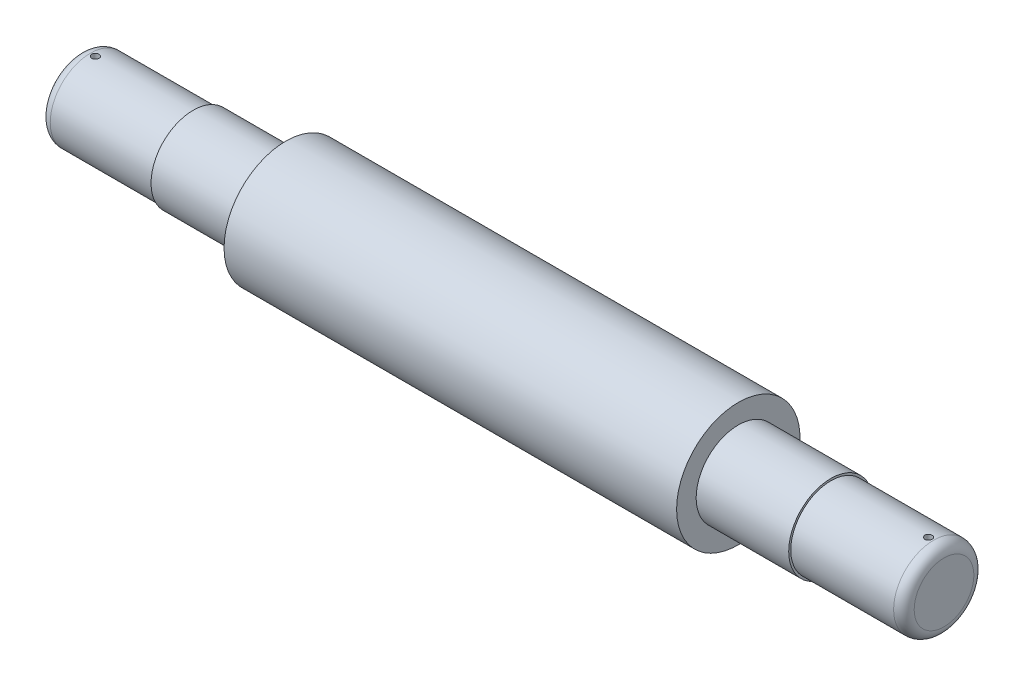
ISO-10303-21;
HEADER;
FILE_DESCRIPTION(('STEP AP214'),'2;1');
FILE_NAME('part.step','',(''),(''),'','','');
FILE_SCHEMA(('AUTOMOTIVE_DESIGN { 1 0 10303 214 1 1 1 1 }'));
ENDSEC;
DATA;
#1=APPLICATION_CONTEXT('core data for automotive mechanical design processes');
#2=APPLICATION_PROTOCOL_DEFINITION('international standard','automotive_design',2000,#1);
#3=PRODUCT_CONTEXT('',#1,'mechanical');
#4=PRODUCT('Part','Part','',(#3));
#5=PRODUCT_RELATED_PRODUCT_CATEGORY('part','',(#4));
#6=PRODUCT_DEFINITION_FORMATION('','',#4);
#7=PRODUCT_DEFINITION_CONTEXT('part definition',#1,'design');
#8=PRODUCT_DEFINITION('design','',#6,#7);
#9=PRODUCT_DEFINITION_SHAPE('','',#8);
#10=(LENGTH_UNIT() NAMED_UNIT(*) SI_UNIT(.MILLI.,.METRE.));
#11=(NAMED_UNIT(*) PLANE_ANGLE_UNIT() SI_UNIT($,.RADIAN.));
#12=(NAMED_UNIT(*) SI_UNIT($,.STERADIAN.) SOLID_ANGLE_UNIT());
#13=UNCERTAINTY_MEASURE_WITH_UNIT(LENGTH_MEASURE(1.E-05),#10,'distance_accuracy_value','');
#14=(GEOMETRIC_REPRESENTATION_CONTEXT(3) GLOBAL_UNCERTAINTY_ASSIGNED_CONTEXT((#13)) GLOBAL_UNIT_ASSIGNED_CONTEXT((#10,
#11,#12)) REPRESENTATION_CONTEXT('',''));
#15=CARTESIAN_POINT('',(0.,0.,0.));
#16=DIRECTION('',(0.,0.,1.));
#17=DIRECTION('',(1.,0.,0.));
#18=AXIS2_PLACEMENT_3D('',#15,#16,#17);
#19=CARTESIAN_POINT('',(48.555065461317,23.4884754613633,0.));
#20=DIRECTION('',(-1.,0.,0.));
#21=DIRECTION('',(0.,0.,1.));
#22=AXIS2_PLACEMENT_3D('',#19,#20,#21);
#23=CYLINDRICAL_SURFACE('',#22,39.);
#24=CARTESIAN_POINT('',(63.555065461317,-15.3541557574406,3.50000000000001));
#25=CARTESIAN_POINT('',(63.7512368152284,-15.3541578341568,3.49999145551542));
#26=CARTESIAN_POINT('',(63.9475403255315,-15.3556578813005,3.48345169220776));
#27=CARTESIAN_POINT('',(64.3347118490182,-15.3614956569584,3.41771718774952));
#28=CARTESIAN_POINT('',(64.5255735138069,-15.3658365687378,3.36848581386032));
#29=CARTESIAN_POINT('',(64.8961980155346,-15.376860489544,3.23880695521626));
#30=CARTESIAN_POINT('',(65.0759672328572,-15.3835421371255,3.15837761326698));
#31=CARTESIAN_POINT('',(65.4194126724575,-15.3984929848442,2.96861914891895));
#32=CARTESIAN_POINT('',(65.5830922366216,-15.406761854251,2.85929604534648));
#33=CARTESIAN_POINT('',(65.8902372036992,-15.4239828637668,2.6145050971832));
#34=CARTESIAN_POINT('',(66.033648442496,-15.4329367396969,2.47896940739303));
#35=CARTESIAN_POINT('',(66.2957200892986,-15.4505030458845,2.18574481528785));
#36=CARTESIAN_POINT('',(66.4143793976001,-15.4591154609575,2.02805492920405));
#37=CARTESIAN_POINT('',(66.6237620275306,-15.4750452009228,1.69467143545592));
#38=CARTESIAN_POINT('',(66.7144380318671,-15.4823603234228,1.51894799581182));
#39=CARTESIAN_POINT('',(66.864977427285,-15.4948524811561,1.15469326390172));
#40=CARTESIAN_POINT('',(66.9248414344557,-15.5000295591393,0.966162227810391));
#41=CARTESIAN_POINT('',(67.0119003596806,-15.5076501582822,0.582186665545917));
#42=CARTESIAN_POINT('',(67.0391834848042,-15.5101010588523,0.386762287366235));
#43=CARTESIAN_POINT('',(67.0605789480137,-15.5120181965239,-0.00590620968397433));
#44=CARTESIAN_POINT('',(67.0546919913814,-15.5114844970855,-0.203150289773911));
#45=CARTESIAN_POINT('',(67.0099863409019,-15.5074986383165,-0.593260809196251));
#46=CARTESIAN_POINT('',(66.9712624981442,-15.5040548849309,-0.786138216066892));
#47=CARTESIAN_POINT('',(66.8621298904162,-15.4946458070888,-1.16264480438846));
#48=CARTESIAN_POINT('',(66.7917207834558,-15.4886804554159,-1.34627388599521));
#49=CARTESIAN_POINT('',(66.6211112126034,-15.4748846639444,-1.69937206503459));
#50=CARTESIAN_POINT('',(66.5208684532224,-15.4670515793967,-1.86882061866413));
#51=CARTESIAN_POINT('',(66.2934678102492,-15.450400111861,-2.18852351631521));
#52=CARTESIAN_POINT('',(66.1663092921916,-15.4415817056492,-2.33877740774117));
#53=CARTESIAN_POINT('',(65.8881525218487,-15.4239134280755,-2.6163807639313));
#54=CARTESIAN_POINT('',(65.7370718162284,-15.415063555371,-2.74364762537274));
#55=CARTESIAN_POINT('',(65.4156461080213,-15.3983609529404,-2.9710256228864));
#56=CARTESIAN_POINT('',(65.2453010856194,-15.39050822424,-3.07113673102592));
#57=CARTESIAN_POINT('',(64.8901222238229,-15.3766878612599,-3.2413592867816));
#58=CARTESIAN_POINT('',(64.705286176112,-15.3707205149972,-3.31146615143586));
#59=CARTESIAN_POINT('',(64.326401091481,-15.3613523551882,-3.41962746054533));
#60=CARTESIAN_POINT('',(64.1323522798194,-15.3579514789244,-3.45768268825988));
#61=CARTESIAN_POINT('',(63.7412736705709,-15.3541117775242,-3.50055529339454));
#62=CARTESIAN_POINT('',(63.5442566124633,-15.3536626750283,-3.50548799670296));
#63=CARTESIAN_POINT('',(63.1521985267533,-15.355750248953,-3.48227790852231));
#64=CARTESIAN_POINT('',(62.957157477749,-15.3582868930004,-3.45413547565214));
#65=CARTESIAN_POINT('',(62.5749208328978,-15.3660507837781,-3.36567024424415));
#66=CARTESIAN_POINT('',(62.3877126215593,-15.3712735085365,-3.30540152357879));
#67=CARTESIAN_POINT('',(62.026064527109,-15.3838173772624,-3.15444958350481));
#68=CARTESIAN_POINT('',(61.8516248809837,-15.3911385601652,-3.06376579976252));
#69=CARTESIAN_POINT('',(61.5199386326445,-15.407079342608,-2.85426715206876));
#70=CARTESIAN_POINT('',(61.3627406438149,-15.4157024583502,-2.73537559317641));
#71=CARTESIAN_POINT('',(61.0704919086639,-15.4332637570525,-2.47294675046716));
#72=CARTESIAN_POINT('',(60.9354416040444,-15.442201946292,-2.32940897523568));
#73=CARTESIAN_POINT('',(60.690926699227,-15.4594170465009,-2.02126313925078));
#74=CARTESIAN_POINT('',(60.5815371398663,-15.4676919725292,-1.85659540709258));
#75=CARTESIAN_POINT('',(60.3919643172158,-15.4826194794186,-1.51116034452477));
#76=CARTESIAN_POINT('',(60.3117807222644,-15.4892720787025,-1.33039319696841));
#77=CARTESIAN_POINT('',(60.1830241948486,-15.5001962970917,-0.95815698288136));
#78=CARTESIAN_POINT('',(60.1344052517367,-15.5044713805053,-0.76670393721284));
#79=CARTESIAN_POINT('',(60.0700078399733,-15.5101730052554,-0.378311887894353));
#80=CARTESIAN_POINT('',(60.0542286404201,-15.5115996099893,-0.18137300643941));
#81=CARTESIAN_POINT('',(60.0559677775512,-15.511443589429,0.211661619986728));
#82=CARTESIAN_POINT('',(60.0733693336731,-15.509871518049,0.407757896423246));
#83=CARTESIAN_POINT('',(60.1407319953062,-15.5039156257297,0.794230391141328));
#84=CARTESIAN_POINT('',(60.1906931388968,-15.4995318015021,0.98460660273284));
#85=CARTESIAN_POINT('',(60.3217260721343,-15.4884440045549,1.35423930296738));
#86=CARTESIAN_POINT('',(60.4027952665748,-15.4817402253835,1.53349671775348));
#87=CARTESIAN_POINT('',(60.5937300921252,-15.4667615166575,1.87587668635211));
#88=CARTESIAN_POINT('',(60.7035953727661,-15.458486606225,2.03899943650183));
#89=CARTESIAN_POINT('',(60.9494422531216,-15.4412590327391,2.34507779768316));
#90=CARTESIAN_POINT('',(61.0855105434563,-15.4323041814419,2.48796365460531));
#91=CARTESIAN_POINT('',(61.3797377879566,-15.4147446280086,2.74893100858392));
#92=CARTESIAN_POINT('',(61.5379020656076,-15.4061400108999,2.86700651097744));
#93=CARTESIAN_POINT('',(61.8721862253256,-15.3902355700081,3.07518877025833));
#94=CARTESIAN_POINT('',(62.0483433419737,-15.3829385417141,3.16523590109129));
#95=CARTESIAN_POINT('',(62.4132251320003,-15.3705092401194,3.31435645502547));
#96=CARTESIAN_POINT('',(62.6019351765156,-15.3653744964054,3.37346524409687));
#97=CARTESIAN_POINT('',(62.9189630883951,-15.3591624139867,3.44409072604449));
#98=CARTESIAN_POINT('',(63.0452462190051,-15.3572936380399,3.46502855109785));
#99=CARTESIAN_POINT('',(63.2993560028734,-15.3547896348484,3.49298595077845));
#100=CARTESIAN_POINT('',(63.4271826511747,-15.3541544036431,3.50000557009309));
#101=CARTESIAN_POINT('',(63.555065461317,-15.3541557574406,3.50000000000001));
#102=B_SPLINE_CURVE_WITH_KNOTS('',3,(#24,#25,#26,#27,#28,#29,#30,#31,#32,#33,#34,#35,#36,#37,
#38,#39,#40,#41,#42,#43,#44,#45,#46,#47,#48,#49,#50,#51,#52,#53,#54,#55,#56,#57,#58,#59,#60,#61,
#62,#63,#64,#65,#66,#67,#68,#69,#70,#71,#72,#73,#74,#75,#76,#77,#78,#79,#80,#81,#82,#83,#84,#85,
#86,#87,#88,#89,#90,#91,#92,#93,#94,#95,#96,#97,#98,#99,#100,#101),.UNSPECIFIED.,.T.,.F.,(4,2,2,
2,2,2,2,2,2,2,2,2,2,2,2,2,2,2,2,2,2,2,2,2,2,2,2,2,2,2,2,2,2,2,2,2,2,2,4),(0.,0.588047108649064,
1.17675427072277,1.76511958921107,2.35336244246258,2.94314870991699,3.53296117542504,
4.12376556522433,4.71455814136408,5.30374759674227,5.89292452447818,6.48040535797843,
7.0678925325154,7.65621659395386,8.24455452506813,8.83496630369428,9.42537868962198,
10.0158812252183,10.606369330037,11.1948004045648,11.7832250990567,12.3706624173001,
12.9581106357017,13.5471747675581,14.136250645977,14.7270282878419,15.3177992206539,
15.9077070630535,16.4976017759585,17.0854241700499,17.6732472516177,18.2610213043753,
18.8487882038323,19.4385341719342,20.0284224706645,20.6195572223366,21.210014757195,
21.5933600148037,21.976704041598),.UNSPECIFIED.);
#103=CARTESIAN_POINT('',(63.555065461317,-15.3541557574406,3.50000000000001));
#104=VERTEX_POINT('',#103);
#105=EDGE_CURVE('E59',#104,#104,#102,.T.);
#106=ORIENTED_EDGE('',*,*,#105,.T.);
#107=EDGE_LOOP('',(#106));
#108=FACE_BOUND('',#107,.T.);
#109=CARTESIAN_POINT('',(63.555065461317,62.3311066801672,3.50000000000001));
#110=CARTESIAN_POINT('',(63.3588941074056,62.3311087568834,3.49999145551542));
#111=CARTESIAN_POINT('',(63.1625905971024,62.3326088040271,3.48345169220776));
#112=CARTESIAN_POINT('',(62.7754190736157,62.338446579685,3.41771718774952));
#113=CARTESIAN_POINT('',(62.584557408827,62.3427874914644,3.36848581386032));
#114=CARTESIAN_POINT('',(62.2139329070994,62.3538114122706,3.23880695521627));
#115=CARTESIAN_POINT('',(62.0341636897768,62.3604930598521,3.15837761326699));
#116=CARTESIAN_POINT('',(61.6907182501765,62.3754439075708,2.96861914891896));
#117=CARTESIAN_POINT('',(61.5270386860123,62.3837127769777,2.85929604534649));
#118=CARTESIAN_POINT('',(61.2198937189347,62.4009337864934,2.61450509718321));
#119=CARTESIAN_POINT('',(61.076482480138,62.4098876624235,2.47896940739304));
#120=CARTESIAN_POINT('',(60.8144108333354,62.4274539686111,2.18574481528786));
#121=CARTESIAN_POINT('',(60.6957515250339,62.4360663836841,2.02805492920406));
#122=CARTESIAN_POINT('',(60.4863688951034,62.4519961236494,1.69467143545593));
#123=CARTESIAN_POINT('',(60.3956928907668,62.4593112461494,1.51894799581183));
#124=CARTESIAN_POINT('',(60.245153495349,62.4718034038827,1.15469326390173));
#125=CARTESIAN_POINT('',(60.1852894881783,62.4769804818659,0.966162227810395));
#126=CARTESIAN_POINT('',(60.0982305629533,62.4846010810088,0.582186665545921));
#127=CARTESIAN_POINT('',(60.0709474378298,62.487051981579,0.386762287366239));
#128=CARTESIAN_POINT('',(60.0495519746202,62.4889691192505,-0.00590620968396851));
#129=CARTESIAN_POINT('',(60.0554389312526,62.4884354198121,-0.203150289773904));
#130=CARTESIAN_POINT('',(60.1001445817321,62.4844495610431,-0.593260809196244));
#131=CARTESIAN_POINT('',(60.1388684244897,62.4810058076575,-0.786138216066885));
#132=CARTESIAN_POINT('',(60.2480010322177,62.4715967298154,-1.16264480438845));
#133=CARTESIAN_POINT('',(60.3184101391781,62.4656313781425,-1.34627388599521));
#134=CARTESIAN_POINT('',(60.4890197100305,62.451835586671,-1.69937206503459));
#135=CARTESIAN_POINT('',(60.5892624694116,62.4440025021233,-1.86882061866413));
#136=CARTESIAN_POINT('',(60.8166631123848,62.4273510345877,-2.18852351631521));
#137=CARTESIAN_POINT('',(60.9438216304424,62.4185326283758,-2.33877740774117));
#138=CARTESIAN_POINT('',(61.2219784007852,62.4008643508021,-2.6163807639313));
#139=CARTESIAN_POINT('',(61.3730591064056,62.3920144780976,-2.74364762537274));
#140=CARTESIAN_POINT('',(61.6944848146126,62.375311875667,-2.9710256228864));
#141=CARTESIAN_POINT('',(61.8648298370146,62.3674591469666,-3.07113673102591));
#142=CARTESIAN_POINT('',(62.2200086988111,62.3536387839866,-3.2413592867816));
#143=CARTESIAN_POINT('',(62.4048447465219,62.3476714377238,-3.31146615143585));
#144=CARTESIAN_POINT('',(62.7837298311529,62.3383032779148,-3.41962746054533));
#145=CARTESIAN_POINT('',(62.9777786428145,62.334902401651,-3.45768268825988));
#146=CARTESIAN_POINT('',(63.3688572520631,62.3310627002508,-3.50055529339454));
#147=CARTESIAN_POINT('',(63.5658743101706,62.3306135977549,-3.50548799670296));
#148=CARTESIAN_POINT('',(63.9579323958806,62.3327011716796,-3.48227790852231));
#149=CARTESIAN_POINT('',(64.1529734448849,62.335237815727,-3.45413547565214));
#150=CARTESIAN_POINT('',(64.5352100897361,62.3430017065048,-3.36567024424415));
#151=CARTESIAN_POINT('',(64.7224183010747,62.3482244312631,-3.30540152357879));
#152=CARTESIAN_POINT('',(65.084066395525,62.360768299989,-3.15444958350481));
#153=CARTESIAN_POINT('',(65.2585060416503,62.3680894828918,-3.06376579976252));
#154=CARTESIAN_POINT('',(65.5901922899895,62.3840302653346,-2.85426715206875));
#155=CARTESIAN_POINT('',(65.7473902788191,62.3926533810768,-2.73537559317641));
#156=CARTESIAN_POINT('',(66.0396390139701,62.4102146797791,-2.47294675046716));
#157=CARTESIAN_POINT('',(66.1746893185896,62.4191528690186,-2.32940897523568));
#158=CARTESIAN_POINT('',(66.419204223407,62.4363679692275,-2.02126313925078));
#159=CARTESIAN_POINT('',(66.5285937827676,62.4446428952558,-1.85659540709257));
#160=CARTESIAN_POINT('',(66.7181666054181,62.4595704021452,-1.51116034452477));
#161=CARTESIAN_POINT('',(66.7983502003696,62.4662230014291,-1.33039319696841));
#162=CARTESIAN_POINT('',(66.9271067277853,62.4771472198183,-0.958156982881361));
#163=CARTESIAN_POINT('',(66.9757256708972,62.4814223032319,-0.76670393721284));
#164=CARTESIAN_POINT('',(67.0401230826607,62.487123927982,-0.378311887894354));
#165=CARTESIAN_POINT('',(67.0559022822138,62.4885505327159,-0.181373006439411));
#166=CARTESIAN_POINT('',(67.0541631450827,62.4883945121556,0.211661619986723));
#167=CARTESIAN_POINT('',(67.0367615889608,62.4868224407756,0.407757896423238));
#168=CARTESIAN_POINT('',(66.9693989273277,62.4808665484563,0.794230391141318));
#169=CARTESIAN_POINT('',(66.9194377837372,62.4764827242287,0.984606602732832));
#170=CARTESIAN_POINT('',(66.7884048504996,62.4653949272815,1.35423930296738));
#171=CARTESIAN_POINT('',(66.7073356560591,62.4586911481101,1.53349671775347));
#172=CARTESIAN_POINT('',(66.5164008305087,62.4437124393841,1.8758766863521));
#173=CARTESIAN_POINT('',(66.4065355498679,62.4354375289516,2.03899943650182));
#174=CARTESIAN_POINT('',(66.1606886695124,62.4182099554657,2.34507779768315));
#175=CARTESIAN_POINT('',(66.0246203791776,62.4092551041686,2.48796365460529));
#176=CARTESIAN_POINT('',(65.7303931346773,62.3916955507352,2.74893100858391));
#177=CARTESIAN_POINT('',(65.5722288570263,62.3830909336265,2.86700651097743));
#178=CARTESIAN_POINT('',(65.2379446973083,62.3671864927347,3.07518877025832));
#179=CARTESIAN_POINT('',(65.0617875806603,62.3598894644407,3.16523590109129));
#180=CARTESIAN_POINT('',(64.6969057906337,62.347460162846,3.31435645502547));
#181=CARTESIAN_POINT('',(64.5081957461183,62.342325419132,3.37346524409687));
#182=CARTESIAN_POINT('',(64.1911678342388,62.3361133367133,3.4440907260445));
#183=CARTESIAN_POINT('',(64.0648847036289,62.3342445607665,3.46502855109785));
#184=CARTESIAN_POINT('',(63.8107749197605,62.331740557575,3.49298595077845));
#185=CARTESIAN_POINT('',(63.6829482714593,62.3311053263697,3.50000557009309));
#186=CARTESIAN_POINT('',(63.555065461317,62.3311066801672,3.50000000000001));
#187=B_SPLINE_CURVE_WITH_KNOTS('',3,(#109,#110,#111,#112,#113,#114,#115,#116,#117,#118,#119,
#120,#121,#122,#123,#124,#125,#126,#127,#128,#129,#130,#131,#132,#133,#134,#135,#136,#137,#138,
#139,#140,#141,#142,#143,#144,#145,#146,#147,#148,#149,#150,#151,#152,#153,#154,#155,#156,#157,
#158,#159,#160,#161,#162,#163,#164,#165,#166,#167,#168,#169,#170,#171,#172,#173,#174,#175,#176,
#177,#178,#179,#180,#181,#182,#183,#184,#185,#186),.UNSPECIFIED.,.T.,.F.,(4,2,2,2,2,2,2,2,2,2,2,
2,2,2,2,2,2,2,2,2,2,2,2,2,2,2,2,2,2,2,2,2,2,2,2,2,2,2,4),(0.,0.588047108649064,1.17675427072276,
1.76511958921106,2.35336244246256,2.94314870991697,3.53296117542502,4.12376556522433,
4.71455814136408,5.30374759674226,5.89292452447817,6.48040535797842,7.06789253251539,
7.65621659395386,8.24455452506813,8.83496630369428,9.42537868962198,10.0158812252183,
10.606369330037,11.1948004045648,11.7832250990567,12.3706624173001,12.9581106357017,
13.5471747675581,14.136250645977,14.7270282878419,15.3177992206539,15.9077070630535,
16.4976017759585,17.0854241700498,17.6732472516177,18.2610213043753,18.8487882038323,
19.4385341719342,20.0284224706645,20.6195572223366,21.210014757195,21.5933600148037,
21.976704041598),.UNSPECIFIED.);
#188=CARTESIAN_POINT('',(63.555065461317,62.3311066801672,3.50000000000001));
#189=VERTEX_POINT('',#188);
#190=EDGE_CURVE('E52',#189,#189,#187,.T.);
#191=ORIENTED_EDGE('',*,*,#190,.T.);
#192=EDGE_LOOP('',(#191));
#193=FACE_BOUND('',#192,.T.);
#194=CARTESIAN_POINT('',(58.555065461317,23.4884754613633,0.));
#195=DIRECTION('',(1.,0.,0.));
#196=DIRECTION('',(0.,0.,-1.));
#197=AXIS2_PLACEMENT_3D('',#194,#195,#196);
#198=CIRCLE('',#197,39.);
#199=CARTESIAN_POINT('',(58.555065461317,23.4884754613633,-39.));
#200=VERTEX_POINT('',#199);
#201=EDGE_CURVE('E48',#200,#200,#198,.T.);
#202=ORIENTED_EDGE('',*,*,#201,.T.);
#203=EDGE_LOOP('',(#202));
#204=FACE_BOUND('',#203,.T.);
#205=CARTESIAN_POINT('',(158.555065461317,23.4884754613633,0.));
#206=DIRECTION('',(-1.,0.,0.));
#207=DIRECTION('',(0.,0.,1.));
#208=AXIS2_PLACEMENT_3D('',#205,#206,#207);
#209=CIRCLE('',#208,39.);
#210=CARTESIAN_POINT('',(158.555065461317,23.4884754613633,39.));
#211=VERTEX_POINT('',#210);
#212=EDGE_CURVE('E127',#211,#211,#209,.T.);
#213=ORIENTED_EDGE('',*,*,#212,.T.);
#214=EDGE_LOOP('',(#213));
#215=FACE_BOUND('',#214,.T.);
#216=ADVANCED_FACE('F31',(#108,#193,#204,#215),#23,.T.);
#217=CARTESIAN_POINT('',(158.555065461317,64.4884754613633,0.));
#218=DIRECTION('',(1.,0.,0.));
#219=DIRECTION('',(0.,0.,-1.));
#220=AXIS2_PLACEMENT_3D('',#217,#218,#219);
#221=PLANE('',#220);
#222=ORIENTED_EDGE('',*,*,#212,.F.);
#223=EDGE_LOOP('',(#222));
#224=FACE_BOUND('',#223,.T.);
#225=CARTESIAN_POINT('',(158.555065461317,23.4884754613633,0.));
#226=DIRECTION('',(-1.,0.,0.));
#227=DIRECTION('',(0.,0.,1.));
#228=AXIS2_PLACEMENT_3D('',#225,#226,#227);
#229=CIRCLE('',#228,41.);
#230=CARTESIAN_POINT('',(158.555065461317,23.4884754613633,41.));
#231=VERTEX_POINT('',#230);
#232=EDGE_CURVE('E129',#231,#231,#229,.T.);
#233=ORIENTED_EDGE('',*,*,#232,.T.);
#234=EDGE_LOOP('',(#233));
#235=FACE_BOUND('',#234,.T.);
#236=ADVANCED_FACE('F109',(#224,#235),#221,.F.);
#237=CARTESIAN_POINT('',(48.555065461317,23.4884754613633,0.));
#238=DIRECTION('',(-1.,0.,0.));
#239=DIRECTION('',(0.,0.,1.));
#240=AXIS2_PLACEMENT_3D('',#237,#238,#239);
#241=CYLINDRICAL_SURFACE('',#240,41.0000000000001);
#242=ORIENTED_EDGE('',*,*,#232,.F.);
#243=EDGE_LOOP('',(#242));
#244=FACE_BOUND('',#243,.T.);
#245=CARTESIAN_POINT('',(248.555065461317,23.4884754613633,0.));
#246=DIRECTION('',(-1.,0.,0.));
#247=DIRECTION('',(0.,0.,1.));
#248=AXIS2_PLACEMENT_3D('',#245,#246,#247);
#249=CIRCLE('',#248,41.0000000000001);
#250=CARTESIAN_POINT('',(248.555065461317,23.4884754613633,41.0000000000001));
#251=VERTEX_POINT('',#250);
#252=EDGE_CURVE('E134',#251,#251,#249,.T.);
#253=ORIENTED_EDGE('',*,*,#252,.T.);
#254=EDGE_LOOP('',(#253));
#255=FACE_BOUND('',#254,.T.);
#256=ADVANCED_FACE('F115',(#244,#255),#241,.T.);
#257=CARTESIAN_POINT('',(248.555065461317,64.4884754613634,0.));
#258=DIRECTION('',(1.,0.,0.));
#259=DIRECTION('',(0.,0.,-1.));
#260=AXIS2_PLACEMENT_3D('',#257,#258,#259);
#261=PLANE('',#260);
#262=ORIENTED_EDGE('',*,*,#252,.F.);
#263=EDGE_LOOP('',(#262));
#264=FACE_BOUND('',#263,.T.);
#265=CARTESIAN_POINT('',(248.555065461317,23.4884754613633,0.));
#266=DIRECTION('',(-1.,0.,0.));
#267=DIRECTION('',(0.,0.,1.));
#268=AXIS2_PLACEMENT_3D('',#265,#266,#267);
#269=CIRCLE('',#268,60.);
#270=CARTESIAN_POINT('',(248.555065461317,23.4884754613633,60.));
#271=VERTEX_POINT('',#270);
#272=EDGE_CURVE('E139',#271,#271,#269,.T.);
#273=ORIENTED_EDGE('',*,*,#272,.T.);
#274=EDGE_LOOP('',(#273));
#275=FACE_BOUND('',#274,.T.);
#276=ADVANCED_FACE('F246',(#264,#275),#261,.F.);
#277=CARTESIAN_POINT('',(48.555065461317,23.4884754613633,0.));
#278=DIRECTION('',(-1.,0.,0.));
#279=DIRECTION('',(0.,0.,1.));
#280=AXIS2_PLACEMENT_3D('',#277,#278,#279);
#281=CYLINDRICAL_SURFACE('',#280,60.);
#282=ORIENTED_EDGE('',*,*,#272,.F.);
#283=EDGE_LOOP('',(#282));
#284=FACE_BOUND('',#283,.T.);
#285=CARTESIAN_POINT('',(688.555065461317,23.4884754613633,0.));
#286=DIRECTION('',(-1.,0.,0.));
#287=DIRECTION('',(0.,0.,1.));
#288=AXIS2_PLACEMENT_3D('',#285,#286,#287);
#289=CIRCLE('',#288,60.);
#290=CARTESIAN_POINT('',(688.555065461317,23.4884754613633,60.));
#291=VERTEX_POINT('',#290);
#292=EDGE_CURVE('E142',#291,#291,#289,.T.);
#293=ORIENTED_EDGE('',*,*,#292,.T.);
#294=EDGE_LOOP('',(#293));
#295=FACE_BOUND('',#294,.T.);
#296=ADVANCED_FACE('F238',(#284,#295),#281,.T.);
#297=CARTESIAN_POINT('',(688.555065461317,64.4884754613634,0.));
#298=DIRECTION('',(-1.,0.,0.));
#299=DIRECTION('',(0.,0.,1.));
#300=AXIS2_PLACEMENT_3D('',#297,#298,#299);
#301=PLANE('',#300);
#302=ORIENTED_EDGE('',*,*,#292,.F.);
#303=EDGE_LOOP('',(#302));
#304=FACE_BOUND('',#303,.T.);
#305=CARTESIAN_POINT('',(688.555065461317,23.4884754613633,0.));
#306=DIRECTION('',(-1.,0.,0.));
#307=DIRECTION('',(0.,0.,1.));
#308=AXIS2_PLACEMENT_3D('',#305,#306,#307);
#309=CIRCLE('',#308,41.0000000000001);
#310=CARTESIAN_POINT('',(688.555065461317,23.4884754613633,41.0000000000001));
#311=VERTEX_POINT('',#310);
#312=EDGE_CURVE('E145',#311,#311,#309,.T.);
#313=ORIENTED_EDGE('',*,*,#312,.T.);
#314=EDGE_LOOP('',(#313));
#315=FACE_BOUND('',#314,.T.);
#316=ADVANCED_FACE('F231',(#304,#315),#301,.F.);
#317=CARTESIAN_POINT('',(48.555065461317,23.4884754613633,0.));
#318=DIRECTION('',(-1.,0.,0.));
#319=DIRECTION('',(0.,0.,1.));
#320=AXIS2_PLACEMENT_3D('',#317,#318,#319);
#321=CYLINDRICAL_SURFACE('',#320,41.0000000000001);
#322=ORIENTED_EDGE('',*,*,#312,.F.);
#323=EDGE_LOOP('',(#322));
#324=FACE_BOUND('',#323,.T.);
#325=CARTESIAN_POINT('',(778.555065461317,23.4884754613633,0.));
#326=DIRECTION('',(-1.,0.,0.));
#327=DIRECTION('',(0.,0.,1.));
#328=AXIS2_PLACEMENT_3D('',#325,#326,#327);
#329=CIRCLE('',#328,41.);
#330=CARTESIAN_POINT('',(778.555065461317,23.4884754613633,41.));
#331=VERTEX_POINT('',#330);
#332=EDGE_CURVE('E148',#331,#331,#329,.T.);
#333=ORIENTED_EDGE('',*,*,#332,.T.);
#334=EDGE_LOOP('',(#333));
#335=FACE_BOUND('',#334,.T.);
#336=ADVANCED_FACE('F225',(#324,#335),#321,.T.);
#337=CARTESIAN_POINT('',(778.555065461317,64.4884754613633,0.));
#338=DIRECTION('',(-1.,0.,0.));
#339=DIRECTION('',(0.,0.,1.));
#340=AXIS2_PLACEMENT_3D('',#337,#338,#339);
#341=PLANE('',#340);
#342=ORIENTED_EDGE('',*,*,#332,.F.);
#343=EDGE_LOOP('',(#342));
#344=FACE_BOUND('',#343,.T.);
#345=CARTESIAN_POINT('',(778.555065461317,23.4884754613633,0.));
#346=DIRECTION('',(-1.,0.,0.));
#347=DIRECTION('',(0.,0.,1.));
#348=AXIS2_PLACEMENT_3D('',#345,#346,#347);
#349=CIRCLE('',#348,39.);
#350=CARTESIAN_POINT('',(778.555065461317,23.4884754613633,39.));
#351=VERTEX_POINT('',#350);
#352=EDGE_CURVE('E151',#351,#351,#349,.T.);
#353=ORIENTED_EDGE('',*,*,#352,.T.);
#354=EDGE_LOOP('',(#353));
#355=FACE_BOUND('',#354,.T.);
#356=ADVANCED_FACE('F91',(#344,#355),#341,.F.);
#357=CARTESIAN_POINT('',(48.555065461317,23.4884754613633,0.));
#358=DIRECTION('',(-1.,0.,0.));
#359=DIRECTION('',(0.,0.,1.));
#360=AXIS2_PLACEMENT_3D('',#357,#358,#359);
#361=CYLINDRICAL_SURFACE('',#360,39.);
#362=CARTESIAN_POINT('',(873.555065461317,-15.3541557574406,3.49999999999997));
#363=CARTESIAN_POINT('',(873.751236815228,-15.3541578341568,3.49999145551537));
#364=CARTESIAN_POINT('',(873.947540325532,-15.3556578813005,3.48345169220772));
#365=CARTESIAN_POINT('',(874.334711849018,-15.3614956569584,3.41771718774949));
#366=CARTESIAN_POINT('',(874.525573513807,-15.3658365687378,3.36848581386028));
#367=CARTESIAN_POINT('',(874.896198015535,-15.376860489544,3.23880695521623));
#368=CARTESIAN_POINT('',(875.075967232857,-15.3835421371255,3.15837761326695));
#369=CARTESIAN_POINT('',(875.419412672457,-15.3984929848442,2.96861914891892));
#370=CARTESIAN_POINT('',(875.583092236622,-15.4067618542511,2.85929604534646));
#371=CARTESIAN_POINT('',(875.890237203699,-15.4239828637668,2.61450509718318));
#372=CARTESIAN_POINT('',(876.033648442496,-15.4329367396969,2.478969407393));
#373=CARTESIAN_POINT('',(876.295720089298,-15.4505030458845,2.18574481528785));
#374=CARTESIAN_POINT('',(876.4143793976,-15.4591154609574,2.02805492920409));
#375=CARTESIAN_POINT('',(876.623762027531,-15.4750452009228,1.69467143545598));
#376=CARTESIAN_POINT('',(876.714438031867,-15.4823603234228,1.51894799581186));
#377=CARTESIAN_POINT('',(876.864977427285,-15.4948524811561,1.15469326390174));
#378=CARTESIAN_POINT('',(876.924841434456,-15.5000295591393,0.966162227810414));
#379=CARTESIAN_POINT('',(877.011900359681,-15.5076501582822,0.582186665545952));
#380=CARTESIAN_POINT('',(877.039183484804,-15.5101010588523,0.386762287366273));
#381=CARTESIAN_POINT('',(877.060578948014,-15.5120181965239,-0.00590620968392937));
#382=CARTESIAN_POINT('',(877.054691991381,-15.5114844970855,-0.203150289773862));
#383=CARTESIAN_POINT('',(877.009986340902,-15.5074986383165,-0.593260809196184));
#384=CARTESIAN_POINT('',(876.971262498144,-15.5040548849309,-0.786138216066811));
#385=CARTESIAN_POINT('',(876.862129890416,-15.4946458070888,-1.16264480438838));
#386=CARTESIAN_POINT('',(876.791720783456,-15.4886804554159,-1.34627388599514));
#387=CARTESIAN_POINT('',(876.621111212603,-15.4748846639444,-1.69937206503454));
#388=CARTESIAN_POINT('',(876.520868453222,-15.4670515793967,-1.86882061866409));
#389=CARTESIAN_POINT('',(876.293467810249,-15.4504001118611,-2.18852351631516));
#390=CARTESIAN_POINT('',(876.166309292191,-15.4415817056492,-2.3387774077411));
#391=CARTESIAN_POINT('',(875.888152521849,-15.4239134280755,-2.61638076393122));
#392=CARTESIAN_POINT('',(875.737071816228,-15.415063555371,-2.74364762537268));
#393=CARTESIAN_POINT('',(875.415646108021,-15.3983609529404,-2.97102562288636));
#394=CARTESIAN_POINT('',(875.245301085619,-15.39050822424,-3.07113673102588));
#395=CARTESIAN_POINT('',(874.890122223823,-15.37668786126,-3.24135928678155));
#396=CARTESIAN_POINT('',(874.705286176112,-15.3707205149972,-3.3114661514358));
#397=CARTESIAN_POINT('',(874.326401091481,-15.3613523551882,-3.41962746054528));
#398=CARTESIAN_POINT('',(874.132352279819,-15.3579514789244,-3.45768268825985));
#399=CARTESIAN_POINT('',(873.741273670571,-15.3541117775242,-3.50055529339451));
#400=CARTESIAN_POINT('',(873.544256612463,-15.3536626750283,-3.50548799670292));
#401=CARTESIAN_POINT('',(873.152198526753,-15.355750248953,-3.48227790852226));
#402=CARTESIAN_POINT('',(872.957157477749,-15.3582868930004,-3.45413547565209));
#403=CARTESIAN_POINT('',(872.574920832898,-15.3660507837782,-3.36567024424411));
#404=CARTESIAN_POINT('',(872.387712621559,-15.3712735085366,-3.30540152357876));
#405=CARTESIAN_POINT('',(872.026064527109,-15.3838173772624,-3.1544495835048));
#406=CARTESIAN_POINT('',(871.851624880984,-15.3911385601652,-3.06376579976251));
#407=CARTESIAN_POINT('',(871.519938632644,-15.407079342608,-2.85426715206874));
#408=CARTESIAN_POINT('',(871.362740643815,-15.4157024583502,-2.73537559317638));
#409=CARTESIAN_POINT('',(871.070491908664,-15.4332637570525,-2.47294675046714));
#410=CARTESIAN_POINT('',(870.935441604045,-15.442201946292,-2.3294089752357));
#411=CARTESIAN_POINT('',(870.690926699227,-15.4594170465009,-2.02126313925082));
#412=CARTESIAN_POINT('',(870.581537139866,-15.4676919725292,-1.8565954070926));
#413=CARTESIAN_POINT('',(870.391964317216,-15.4826194794186,-1.51116034452478));
#414=CARTESIAN_POINT('',(870.311780722264,-15.4892720787025,-1.33039319696841));
#415=CARTESIAN_POINT('',(870.183024194849,-15.5001962970917,-0.958156982881376));
#416=CARTESIAN_POINT('',(870.134405251737,-15.5044713805053,-0.766703937212871));
#417=CARTESIAN_POINT('',(870.070007839973,-15.5101730052554,-0.378311887894405));
#418=CARTESIAN_POINT('',(870.05422864042,-15.5115996099893,-0.181373006439465));
#419=CARTESIAN_POINT('',(870.055967777551,-15.511443589429,0.211661619986676));
#420=CARTESIAN_POINT('',(870.073369333673,-15.509871518049,0.407757896423202));
#421=CARTESIAN_POINT('',(870.140731995306,-15.5039156257297,0.794230391141283));
#422=CARTESIAN_POINT('',(870.190693138897,-15.4995318015021,0.984606602732785));
#423=CARTESIAN_POINT('',(870.321726072134,-15.4884440045549,1.35423930296733));
#424=CARTESIAN_POINT('',(870.402795266575,-15.4817402253835,1.53349671775343));
#425=CARTESIAN_POINT('',(870.593730092125,-15.4667615166575,1.87587668635206));
#426=CARTESIAN_POINT('',(870.703595372766,-15.458486606225,2.03899943650178));
#427=CARTESIAN_POINT('',(870.949442253122,-15.4412590327391,2.3450777976831));
#428=CARTESIAN_POINT('',(871.085510543456,-15.4323041814419,2.48796365460523));
#429=CARTESIAN_POINT('',(871.379737787957,-15.4147446280086,2.74893100858384));
#430=CARTESIAN_POINT('',(871.537902065608,-15.4061400108999,2.86700651097737));
#431=CARTESIAN_POINT('',(871.872186225326,-15.3902355700081,3.07518877025828));
#432=CARTESIAN_POINT('',(872.048343341974,-15.3829385417141,3.16523590109124));
#433=CARTESIAN_POINT('',(872.413225132,-15.3705092401194,3.3143564550254));
#434=CARTESIAN_POINT('',(872.601935176516,-15.3653744964054,3.37346524409681));
#435=CARTESIAN_POINT('',(872.918963088395,-15.3591624139867,3.44409072604445));
#436=CARTESIAN_POINT('',(873.045246219005,-15.3572936380399,3.46502855109782));
#437=CARTESIAN_POINT('',(873.299356002873,-15.3547896348484,3.49298595077841));
#438=CARTESIAN_POINT('',(873.427182651175,-15.3541544036431,3.50000557009305));
#439=CARTESIAN_POINT('',(873.555065461317,-15.3541557574406,3.49999999999997));
#440=B_SPLINE_CURVE_WITH_KNOTS('',3,(#362,#363,#364,#365,#366,#367,#368,#369,#370,#371,#372,
#373,#374,#375,#376,#377,#378,#379,#380,#381,#382,#383,#384,#385,#386,#387,#388,#389,#390,#391,
#392,#393,#394,#395,#396,#397,#398,#399,#400,#401,#402,#403,#404,#405,#406,#407,#408,#409,#410,
#411,#412,#413,#414,#415,#416,#417,#418,#419,#420,#421,#422,#423,#424,#425,#426,#427,#428,#429,
#430,#431,#432,#433,#434,#435,#436,#437,#438,#439),.UNSPECIFIED.,.T.,.F.,(4,2,2,2,2,2,2,2,2,2,2,
2,2,2,2,2,2,2,2,2,2,2,2,2,2,2,2,2,2,2,2,2,2,2,2,2,2,2,4),(0.,0.58804710864898,1.17675427072274,
1.76511958921111,2.35336244246253,2.9431487099169,3.5329611754249,4.12376556522422,
4.71455814136396,5.30374759674214,5.89292452447804,6.48040535797824,7.06789253251525,
7.65621659395371,8.244554525068,8.8349663036941,9.42537868962185,10.0158812252182,
10.6063693300368,11.1948004045648,11.7832250990566,12.3706624172999,12.9581106357016,
13.547174767558,14.1362506459768,14.7270282878417,15.3177992206537,15.9077070630532,
16.4976017759582,17.0854241700496,17.6732472516175,18.261021304375,18.8487882038321,
19.4385341719339,20.0284224706641,20.6195572223363,21.2100147571947,21.5933600148035,
21.9767040415977),.UNSPECIFIED.);
#441=CARTESIAN_POINT('',(873.555065461317,-15.3541557574406,3.49999999999997));
#442=VERTEX_POINT('',#441);
#443=EDGE_CURVE('E35',#442,#442,#440,.T.);
#444=ORIENTED_EDGE('',*,*,#443,.T.);
#445=EDGE_LOOP('',(#444));
#446=FACE_BOUND('',#445,.T.);
#447=CARTESIAN_POINT('',(873.555065461317,62.3311066801672,3.49999999999997));
#448=CARTESIAN_POINT('',(873.358894107406,62.3311087568834,3.49999145551537));
#449=CARTESIAN_POINT('',(873.162590597102,62.3326088040271,3.48345169220772));
#450=CARTESIAN_POINT('',(872.775419073616,62.338446579685,3.41771718774949));
#451=CARTESIAN_POINT('',(872.584557408827,62.3427874914644,3.36848581386028));
#452=CARTESIAN_POINT('',(872.213932907099,62.3538114122706,3.23880695521623));
#453=CARTESIAN_POINT('',(872.034163689777,62.3604930598521,3.15837761326695));
#454=CARTESIAN_POINT('',(871.690718250176,62.3754439075708,2.96861914891892));
#455=CARTESIAN_POINT('',(871.527038686012,62.3837127769777,2.85929604534646));
#456=CARTESIAN_POINT('',(871.219893718935,62.4009337864934,2.61450509718318));
#457=CARTESIAN_POINT('',(871.076482480138,62.4098876624235,2.478969407393));
#458=CARTESIAN_POINT('',(870.814410833336,62.4274539686111,2.18574481528785));
#459=CARTESIAN_POINT('',(870.695751525034,62.4360663836841,2.02805492920409));
#460=CARTESIAN_POINT('',(870.486368895103,62.4519961236494,1.69467143545598));
#461=CARTESIAN_POINT('',(870.395692890767,62.4593112461494,1.51894799581185));
#462=CARTESIAN_POINT('',(870.245153495349,62.4718034038827,1.15469326390174));
#463=CARTESIAN_POINT('',(870.185289488178,62.4769804818659,0.966162227810414));
#464=CARTESIAN_POINT('',(870.098230562953,62.4846010810088,0.582186665545953));
#465=CARTESIAN_POINT('',(870.07094743783,62.487051981579,0.386762287366273));
#466=CARTESIAN_POINT('',(870.04955197462,62.4889691192505,-0.00590620968392907));
#467=CARTESIAN_POINT('',(870.055438931253,62.4884354198121,-0.203150289773861));
#468=CARTESIAN_POINT('',(870.100144581732,62.4844495610431,-0.593260809196183));
#469=CARTESIAN_POINT('',(870.13886842449,62.4810058076575,-0.786138216066811));
#470=CARTESIAN_POINT('',(870.248001032218,62.4715967298154,-1.16264480438837));
#471=CARTESIAN_POINT('',(870.318410139178,62.4656313781425,-1.34627388599514));
#472=CARTESIAN_POINT('',(870.489019710031,62.451835586671,-1.69937206503454));
#473=CARTESIAN_POINT('',(870.589262469412,62.4440025021233,-1.86882061866409));
#474=CARTESIAN_POINT('',(870.816663112385,62.4273510345877,-2.18852351631516));
#475=CARTESIAN_POINT('',(870.943821630442,62.4185326283758,-2.3387774077411));
#476=CARTESIAN_POINT('',(871.221978400785,62.4008643508021,-2.61638076393122));
#477=CARTESIAN_POINT('',(871.373059106406,62.3920144780976,-2.74364762537268));
#478=CARTESIAN_POINT('',(871.694484814613,62.375311875667,-2.97102562288636));
#479=CARTESIAN_POINT('',(871.864829837015,62.3674591469666,-3.07113673102588));
#480=CARTESIAN_POINT('',(872.220008698811,62.3536387839866,-3.24135928678155));
#481=CARTESIAN_POINT('',(872.404844746522,62.3476714377238,-3.3114661514358));
#482=CARTESIAN_POINT('',(872.783729831153,62.3383032779149,-3.41962746054528));
#483=CARTESIAN_POINT('',(872.977778642815,62.334902401651,-3.45768268825985));
#484=CARTESIAN_POINT('',(873.368857252063,62.3310627002508,-3.5005552933945));
#485=CARTESIAN_POINT('',(873.565874310171,62.3306135977549,-3.50548799670292));
#486=CARTESIAN_POINT('',(873.95793239588,62.3327011716796,-3.48227790852229));
#487=CARTESIAN_POINT('',(874.152973444885,62.335237815727,-3.45413547565212));
#488=CARTESIAN_POINT('',(874.535210089736,62.3430017065048,-3.36567024424411));
#489=CARTESIAN_POINT('',(874.722418301075,62.3482244312631,-3.30540152357876));
#490=CARTESIAN_POINT('',(875.084066395525,62.360768299989,-3.1544495835048));
#491=CARTESIAN_POINT('',(875.25850604165,62.3680894828918,-3.06376579976251));
#492=CARTESIAN_POINT('',(875.590192289989,62.3840302653346,-2.85426715206877));
#493=CARTESIAN_POINT('',(875.747390278819,62.3926533810768,-2.73537559317644));
#494=CARTESIAN_POINT('',(876.03963901397,62.4102146797791,-2.47294675046722));
#495=CARTESIAN_POINT('',(876.17468931859,62.4191528690186,-2.32940897523574));
#496=CARTESIAN_POINT('',(876.419204223407,62.4363679692275,-2.02126313925082));
#497=CARTESIAN_POINT('',(876.528593782768,62.4446428952558,-1.8565954070926));
#498=CARTESIAN_POINT('',(876.718166605418,62.4595704021452,-1.51116034452478));
#499=CARTESIAN_POINT('',(876.79835020037,62.4662230014291,-1.33039319696841));
#500=CARTESIAN_POINT('',(876.927106727785,62.4771472198183,-0.95815698288137));
#501=CARTESIAN_POINT('',(876.975725670897,62.4814223032319,-0.766703937212859));
#502=CARTESIAN_POINT('',(877.040123082661,62.487123927982,-0.378311887894392));
#503=CARTESIAN_POINT('',(877.055902282214,62.4885505327159,-0.181373006439459));
#504=CARTESIAN_POINT('',(877.054163145083,62.4883945121556,0.211661619986669));
#505=CARTESIAN_POINT('',(877.036761588961,62.4868224407756,0.407757896423188));
#506=CARTESIAN_POINT('',(876.969398927328,62.4808665484563,0.79423039114127));
#507=CARTESIAN_POINT('',(876.919437783737,62.4764827242287,0.98460660273278));
#508=CARTESIAN_POINT('',(876.7884048505,62.4653949272815,1.35423930296731));
#509=CARTESIAN_POINT('',(876.707335656059,62.4586911481101,1.5334967177534));
#510=CARTESIAN_POINT('',(876.516400830509,62.4437124393841,1.87587668635203));
#511=CARTESIAN_POINT('',(876.406535549868,62.4354375289516,2.03899943650176));
#512=CARTESIAN_POINT('',(876.160688669512,62.4182099554657,2.34507779768307));
#513=CARTESIAN_POINT('',(876.024620379178,62.4092551041686,2.48796365460519));
#514=CARTESIAN_POINT('',(875.730393134677,62.3916955507353,2.74893100858382));
#515=CARTESIAN_POINT('',(875.572228857026,62.3830909336265,2.86700651097735));
#516=CARTESIAN_POINT('',(875.237944697308,62.3671864927347,3.07518877025825));
#517=CARTESIAN_POINT('',(875.06178758066,62.3598894644407,3.1652359010912));
#518=CARTESIAN_POINT('',(874.696905790634,62.347460162846,3.31435645502538));
#519=CARTESIAN_POINT('',(874.508195746118,62.342325419132,3.3734652440968));
#520=CARTESIAN_POINT('',(874.191167834239,62.3361133367133,3.44409072604445));
#521=CARTESIAN_POINT('',(874.064884703629,62.3342445607665,3.46502855109782));
#522=CARTESIAN_POINT('',(873.810774919761,62.331740557575,3.49298595077841));
#523=CARTESIAN_POINT('',(873.682948271459,62.3311053263697,3.50000557009305));
#524=CARTESIAN_POINT('',(873.555065461317,62.3311066801672,3.49999999999997));
#525=B_SPLINE_CURVE_WITH_KNOTS('',3,(#447,#448,#449,#450,#451,#452,#453,#454,#455,#456,#457,
#458,#459,#460,#461,#462,#463,#464,#465,#466,#467,#468,#469,#470,#471,#472,#473,#474,#475,#476,
#477,#478,#479,#480,#481,#482,#483,#484,#485,#486,#487,#488,#489,#490,#491,#492,#493,#494,#495,
#496,#497,#498,#499,#500,#501,#502,#503,#504,#505,#506,#507,#508,#509,#510,#511,#512,#513,#514,
#515,#516,#517,#518,#519,#520,#521,#522,#523,#524),.UNSPECIFIED.,.T.,.F.,(4,2,2,2,2,2,2,2,2,2,2,
2,2,2,2,2,2,2,2,2,2,2,2,2,2,2,2,2,2,2,2,2,2,2,2,2,2,2,4),(0.,0.58804710864898,1.17675427072274,
1.76511958921111,2.35336244246253,2.9431487099169,3.5329611754249,4.12376556522422,
4.71455814136396,5.30374759674214,5.89292452447804,6.48040535797824,7.06789253251525,
7.65621659395371,8.244554525068,8.8349663036941,9.42537868962185,10.0158812252182,
10.6063693300368,11.1948004045644,11.7832250990566,12.3706624172999,12.9581106357016,
13.5471747675578,14.1362506459768,14.7270282878417,15.3177992206537,15.9077070630532,
16.4976017759582,17.0854241700496,17.6732472516174,18.261021304375,18.8487882038321,
19.4385341719338,20.0284224706641,20.6195572223362,21.2100147571947,21.5933600148035,
21.9767040415977),.UNSPECIFIED.);
#526=CARTESIAN_POINT('',(873.555065461317,62.3311066801672,3.49999999999997));
#527=VERTEX_POINT('',#526);
#528=EDGE_CURVE('E95',#527,#527,#525,.T.);
#529=ORIENTED_EDGE('',*,*,#528,.T.);
#530=EDGE_LOOP('',(#529));
#531=FACE_BOUND('',#530,.T.);
#532=CARTESIAN_POINT('',(878.555065461317,23.4884754613633,0.));
#533=DIRECTION('',(-1.,0.,0.));
#534=DIRECTION('',(0.,0.,1.));
#535=AXIS2_PLACEMENT_3D('',#532,#533,#534);
#536=CIRCLE('',#535,39.);
#537=CARTESIAN_POINT('',(878.555065461317,23.4884754613633,39.));
#538=VERTEX_POINT('',#537);
#539=EDGE_CURVE('E43',#538,#538,#536,.T.);
#540=ORIENTED_EDGE('',*,*,#539,.T.);
#541=EDGE_LOOP('',(#540));
#542=FACE_BOUND('',#541,.T.);
#543=ORIENTED_EDGE('',*,*,#352,.F.);
#544=EDGE_LOOP('',(#543));
#545=FACE_BOUND('',#544,.T.);
#546=ADVANCED_FACE('F87',(#446,#531,#542,#545),#361,.T.);
#547=CARTESIAN_POINT('',(888.555065461317,23.4884754613633,0.));
#548=DIRECTION('',(-1.,0.,0.));
#549=DIRECTION('',(0.,0.,1.));
#550=AXIS2_PLACEMENT_3D('',#547,#548,#549);
#551=PLANE('',#550);
#552=CARTESIAN_POINT('',(888.555065461317,23.4884754613633,0.));
#553=DIRECTION('',(-1.,0.,0.));
#554=DIRECTION('',(0.,0.,1.));
#555=AXIS2_PLACEMENT_3D('',#552,#553,#554);
#556=CIRCLE('',#555,29.);
#557=CARTESIAN_POINT('',(888.555065461317,23.4884754613633,29.));
#558=VERTEX_POINT('',#557);
#559=EDGE_CURVE('E10',#558,#558,#556,.F.);
#560=ORIENTED_EDGE('',*,*,#559,.T.);
#561=EDGE_LOOP('',(#560));
#562=FACE_BOUND('',#561,.T.);
#563=ADVANCED_FACE('F84',(#562),#551,.F.);
#564=CARTESIAN_POINT('',(48.555065461317,23.4884754613633,0.));
#565=DIRECTION('',(1.,0.,0.));
#566=DIRECTION('',(0.,0.,-1.));
#567=AXIS2_PLACEMENT_3D('',#564,#565,#566);
#568=PLANE('',#567);
#569=CARTESIAN_POINT('',(48.555065461317,23.4884754613633,0.));
#570=DIRECTION('',(-1.,0.,0.));
#571=DIRECTION('',(0.,0.,1.));
#572=AXIS2_PLACEMENT_3D('',#569,#570,#571);
#573=CIRCLE('',#572,3.75);
#574=CARTESIAN_POINT('',(48.555065461317,23.4884754613633,3.75));
#575=VERTEX_POINT('',#574);
#576=EDGE_CURVE('E155',#575,#575,#573,.T.);
#577=ORIENTED_EDGE('',*,*,#576,.F.);
#578=EDGE_LOOP('',(#577));
#579=FACE_BOUND('',#578,.T.);
#580=CARTESIAN_POINT('',(48.555065461317,23.4884754613633,0.));
#581=DIRECTION('',(1.,0.,0.));
#582=DIRECTION('',(0.,0.,-1.));
#583=AXIS2_PLACEMENT_3D('',#580,#581,#582);
#584=CIRCLE('',#583,29.);
#585=CARTESIAN_POINT('',(48.555065461317,23.4884754613633,-29.));
#586=VERTEX_POINT('',#585);
#587=EDGE_CURVE('E128',#586,#586,#584,.F.);
#588=ORIENTED_EDGE('',*,*,#587,.T.);
#589=EDGE_LOOP('',(#588));
#590=FACE_BOUND('',#589,.T.);
#591=ADVANCED_FACE('F81',(#579,#590),#568,.F.);
#592=CARTESIAN_POINT('',(58.555065461317,23.4884754613633,0.));
#593=DIRECTION('',(1.,0.,0.));
#594=DIRECTION('',(0.,0.,-1.));
#595=AXIS2_PLACEMENT_3D('',#592,#593,#594);
#596=TOROIDAL_SURFACE('',#595,29.,10.);
#597=ORIENTED_EDGE('',*,*,#201,.F.);
#598=EDGE_LOOP('',(#597));
#599=FACE_BOUND('',#598,.T.);
#600=ORIENTED_EDGE('',*,*,#587,.F.);
#601=EDGE_LOOP('',(#600));
#602=FACE_BOUND('',#601,.T.);
#603=ADVANCED_FACE('F79',(#599,#602),#596,.T.);
#604=CARTESIAN_POINT('',(58.555065461317,23.4884754613633,0.));
#605=DIRECTION('',(-1.,0.,0.));
#606=DIRECTION('',(0.,0.,1.));
#607=AXIS2_PLACEMENT_3D('',#604,#605,#606);
#608=CYLINDRICAL_SURFACE('',#607,3.75);
#609=CARTESIAN_POINT('',(58.555065461317,23.4884754613633,0.));
#610=DIRECTION('',(-1.,0.,0.));
#611=DIRECTION('',(0.,0.,1.));
#612=AXIS2_PLACEMENT_3D('',#609,#610,#611);
#613=CIRCLE('',#612,3.75);
#614=CARTESIAN_POINT('',(58.555065461317,23.4884754613633,3.75));
#615=VERTEX_POINT('',#614);
#616=EDGE_CURVE('E154',#615,#615,#613,.T.);
#617=ORIENTED_EDGE('',*,*,#616,.F.);
#618=EDGE_LOOP('',(#617));
#619=FACE_BOUND('',#618,.T.);
#620=ORIENTED_EDGE('',*,*,#576,.T.);
#621=EDGE_LOOP('',(#620));
#622=FACE_BOUND('',#621,.T.);
#623=ADVANCED_FACE('F75',(#619,#622),#608,.F.);
#624=CARTESIAN_POINT('',(58.555065461317,23.4884754613633,0.));
#625=DIRECTION('',(-1.,0.,0.));
#626=DIRECTION('',(0.,0.,1.));
#627=AXIS2_PLACEMENT_3D('',#624,#625,#626);
#628=PLANE('',#627);
#629=ORIENTED_EDGE('',*,*,#616,.T.);
#630=EDGE_LOOP('',(#629));
#631=FACE_BOUND('',#630,.T.);
#632=ADVANCED_FACE('F71',(#631),#628,.T.);
#633=CARTESIAN_POINT('',(878.555065461317,23.4884754613633,0.));
#634=DIRECTION('',(-1.,0.,0.));
#635=DIRECTION('',(0.,0.,1.));
#636=AXIS2_PLACEMENT_3D('',#633,#634,#635);
#637=TOROIDAL_SURFACE('',#636,29.,10.);
#638=ORIENTED_EDGE('',*,*,#559,.F.);
#639=EDGE_LOOP('',(#638));
#640=FACE_BOUND('',#639,.T.);
#641=ORIENTED_EDGE('',*,*,#539,.F.);
#642=EDGE_LOOP('',(#641));
#643=FACE_BOUND('',#642,.T.);
#644=ADVANCED_FACE('F33',(#640,#643),#637,.T.);
#645=CARTESIAN_POINT('',(63.555065461317,-36.5115245386367,0.));
#646=DIRECTION('',(0.,1.,0.));
#647=DIRECTION('',(0.,0.,1.));
#648=AXIS2_PLACEMENT_3D('',#645,#646,#647);
#649=CYLINDRICAL_SURFACE('',#648,3.50000000000001);
#650=ORIENTED_EDGE('',*,*,#190,.F.);
#651=EDGE_LOOP('',(#650));
#652=FACE_BOUND('',#651,.T.);
#653=ORIENTED_EDGE('',*,*,#105,.F.);
#654=EDGE_LOOP('',(#653));
#655=FACE_BOUND('',#654,.T.);
#656=ADVANCED_FACE('F64',(#652,#655),#649,.F.);
#657=CARTESIAN_POINT('',(873.555065461317,-36.5115245386367,0.));
#658=DIRECTION('',(0.,1.,0.));
#659=DIRECTION('',(0.,0.,1.));
#660=AXIS2_PLACEMENT_3D('',#657,#658,#659);
#661=CYLINDRICAL_SURFACE('',#660,3.49999999999997);
#662=ORIENTED_EDGE('',*,*,#528,.F.);
#663=EDGE_LOOP('',(#662));
#664=FACE_BOUND('',#663,.T.);
#665=ORIENTED_EDGE('',*,*,#443,.F.);
#666=EDGE_LOOP('',(#665));
#667=FACE_BOUND('',#666,.T.);
#668=ADVANCED_FACE('F68',(#664,#667),#661,.F.);
#669=CLOSED_SHELL('',(#216,#236,#256,#276,#296,#316,#336,#356,#546,#563,#591,#603,#623,#632,
#644,#656,#668));
#670=MANIFOLD_SOLID_BREP('B2',#669);
#671=ADVANCED_BREP_SHAPE_REPRESENTATION('',(#18,#670),#14);
#672=SHAPE_DEFINITION_REPRESENTATION(#9,#671);
ENDSEC;
END-ISO-10303-21;
